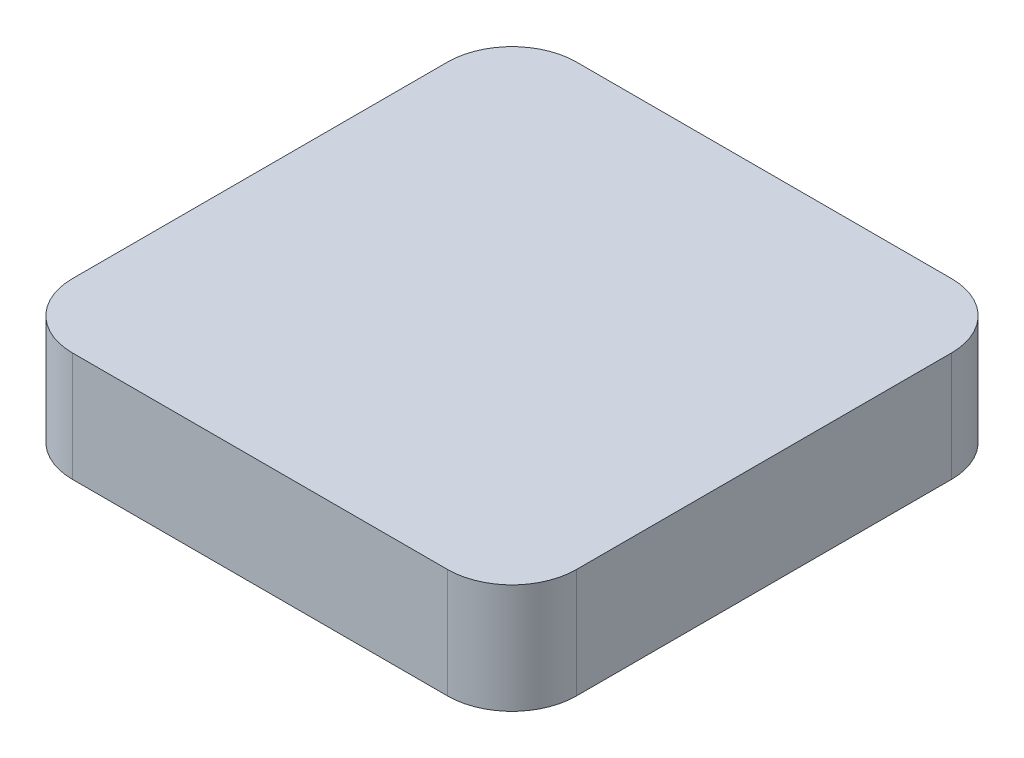
ISO-10303-21;
HEADER;
FILE_DESCRIPTION(('STEP AP214'),'2;1');
FILE_NAME('part.step','',(''),(''),'','','');
FILE_SCHEMA(('AUTOMOTIVE_DESIGN { 1 0 10303 214 1 1 1 1 }'));
ENDSEC;
DATA;
#1=APPLICATION_CONTEXT('core data for automotive mechanical design processes');
#2=APPLICATION_PROTOCOL_DEFINITION('international standard','automotive_design',2000,#1);
#3=PRODUCT_CONTEXT('',#1,'mechanical');
#4=PRODUCT('Part','Part','',(#3));
#5=PRODUCT_RELATED_PRODUCT_CATEGORY('part','',(#4));
#6=PRODUCT_DEFINITION_FORMATION('','',#4);
#7=PRODUCT_DEFINITION_CONTEXT('part definition',#1,'design');
#8=PRODUCT_DEFINITION('design','',#6,#7);
#9=PRODUCT_DEFINITION_SHAPE('','',#8);
#10=(LENGTH_UNIT() NAMED_UNIT(*) SI_UNIT(.MILLI.,.METRE.));
#11=(NAMED_UNIT(*) PLANE_ANGLE_UNIT() SI_UNIT($,.RADIAN.));
#12=(NAMED_UNIT(*) SI_UNIT($,.STERADIAN.) SOLID_ANGLE_UNIT());
#13=UNCERTAINTY_MEASURE_WITH_UNIT(LENGTH_MEASURE(1.E-05),#10,'distance_accuracy_value','');
#14=(GEOMETRIC_REPRESENTATION_CONTEXT(3) GLOBAL_UNCERTAINTY_ASSIGNED_CONTEXT((#13)) GLOBAL_UNIT_ASSIGNED_CONTEXT((#10,
#11,#12)) REPRESENTATION_CONTEXT('',''));
#15=CARTESIAN_POINT('',(0.,0.,0.));
#16=DIRECTION('',(0.,0.,1.));
#17=DIRECTION('',(1.,0.,0.));
#18=AXIS2_PLACEMENT_3D('',#15,#16,#17);
#19=CARTESIAN_POINT('',(10.1927350427351,8.5,-18.1297008547008));
#20=DIRECTION('',(-1.,0.,0.));
#21=DIRECTION('',(0.,0.,1.));
#22=AXIS2_PLACEMENT_3D('',#19,#20,#21);
#23=PLANE('',#22);
#24=DIRECTION('',(0.,0.,-1.));
#25=VECTOR('',#24,1.);
#26=CARTESIAN_POINT('',(10.1927350427351,0.,-18.1297008547008));
#27=LINE('',#26,#25);
#28=CARTESIAN_POINT('',(10.1927350427351,0.,15.9702991452992));
#29=VERTEX_POINT('',#28);
#30=CARTESIAN_POINT('',(10.1927350427351,0.,-13.1297008547008));
#31=VERTEX_POINT('',#30);
#32=EDGE_CURVE('E128',#29,#31,#27,.T.);
#33=ORIENTED_EDGE('',*,*,#32,.T.);
#34=DIRECTION('',(0.,-1.,0.));
#35=VECTOR('',#34,1.);
#36=CARTESIAN_POINT('',(10.1927350427351,8.5,-13.1297008547008));
#37=LINE('',#36,#35);
#38=CARTESIAN_POINT('',(10.1927350427351,8.5,-13.1297008547008));
#39=VERTEX_POINT('',#38);
#40=EDGE_CURVE('E106',#31,#39,#37,.F.);
#41=ORIENTED_EDGE('',*,*,#40,.T.);
#42=DIRECTION('',(0.,0.,-1.));
#43=VECTOR('',#42,1.);
#44=CARTESIAN_POINT('',(10.1927350427351,8.5,-18.1297008547008));
#45=LINE('',#44,#43);
#46=CARTESIAN_POINT('',(10.1927350427351,8.5,15.9702991452992));
#47=VERTEX_POINT('',#46);
#48=EDGE_CURVE('E137',#47,#39,#45,.T.);
#49=ORIENTED_EDGE('',*,*,#48,.F.);
#50=DIRECTION('',(0.,-1.,0.));
#51=VECTOR('',#50,1.);
#52=CARTESIAN_POINT('',(10.1927350427351,8.5,15.9702991452992));
#53=LINE('',#52,#51);
#54=EDGE_CURVE('E111',#47,#29,#53,.T.);
#55=ORIENTED_EDGE('',*,*,#54,.T.);
#56=EDGE_LOOP('',(#33,#41,#49,#55));
#57=FACE_BOUND('',#56,.T.);
#58=ADVANCED_FACE('F35',(#57),#23,.F.);
#59=CARTESIAN_POINT('',(-28.907264957265,8.5,-18.1297008547008));
#60=DIRECTION('',(0.,0.,1.));
#61=DIRECTION('',(1.,0.,0.));
#62=AXIS2_PLACEMENT_3D('',#59,#60,#61);
#63=PLANE('',#62);
#64=DIRECTION('',(-1.,0.,0.));
#65=VECTOR('',#64,1.);
#66=CARTESIAN_POINT('',(-28.907264957265,8.5,-18.1297008547008));
#67=LINE('',#66,#65);
#68=CARTESIAN_POINT('',(5.19273504273505,8.5,-18.1297008547008));
#69=VERTEX_POINT('',#68);
#70=CARTESIAN_POINT('',(-23.907264957265,8.5,-18.1297008547008));
#71=VERTEX_POINT('',#70);
#72=EDGE_CURVE('E121',#69,#71,#67,.T.);
#73=ORIENTED_EDGE('',*,*,#72,.F.);
#74=DIRECTION('',(0.,-1.,0.));
#75=VECTOR('',#74,1.);
#76=CARTESIAN_POINT('',(5.19273504273505,8.5,-18.1297008547008));
#77=LINE('',#76,#75);
#78=CARTESIAN_POINT('',(5.19273504273505,0.,-18.1297008547008));
#79=VERTEX_POINT('',#78);
#80=EDGE_CURVE('E105',#69,#79,#77,.T.);
#81=ORIENTED_EDGE('',*,*,#80,.T.);
#82=DIRECTION('',(-1.,0.,0.));
#83=VECTOR('',#82,1.);
#84=CARTESIAN_POINT('',(-28.907264957265,0.,-18.1297008547008));
#85=LINE('',#84,#83);
#86=CARTESIAN_POINT('',(-23.907264957265,0.,-18.1297008547008));
#87=VERTEX_POINT('',#86);
#88=EDGE_CURVE('E118',#79,#87,#85,.T.);
#89=ORIENTED_EDGE('',*,*,#88,.T.);
#90=DIRECTION('',(0.,-1.,0.));
#91=VECTOR('',#90,1.);
#92=CARTESIAN_POINT('',(-23.907264957265,8.5,-18.1297008547008));
#93=LINE('',#92,#91);
#94=EDGE_CURVE('E123',#87,#71,#93,.F.);
#95=ORIENTED_EDGE('',*,*,#94,.T.);
#96=EDGE_LOOP('',(#73,#81,#89,#95));
#97=FACE_BOUND('',#96,.T.);
#98=ADVANCED_FACE('F117',(#97),#63,.F.);
#99=CARTESIAN_POINT('',(-28.907264957265,8.5,-18.1297008547008));
#100=DIRECTION('',(1.,0.,0.));
#101=DIRECTION('',(0.,0.,-1.));
#102=AXIS2_PLACEMENT_3D('',#99,#100,#101);
#103=PLANE('',#102);
#104=DIRECTION('',(0.,0.,1.));
#105=VECTOR('',#104,1.);
#106=CARTESIAN_POINT('',(-28.907264957265,0.,-18.1297008547008));
#107=LINE('',#106,#105);
#108=CARTESIAN_POINT('',(-28.907264957265,0.,-13.1297008547008));
#109=VERTEX_POINT('',#108);
#110=CARTESIAN_POINT('',(-28.907264957265,0.,15.9702991452992));
#111=VERTEX_POINT('',#110);
#112=EDGE_CURVE('E127',#109,#111,#107,.T.);
#113=ORIENTED_EDGE('',*,*,#112,.T.);
#114=DIRECTION('',(0.,-1.,0.));
#115=VECTOR('',#114,1.);
#116=CARTESIAN_POINT('',(-28.907264957265,8.5,15.9702991452992));
#117=LINE('',#116,#115);
#118=CARTESIAN_POINT('',(-28.907264957265,8.5,15.9702991452992));
#119=VERTEX_POINT('',#118);
#120=EDGE_CURVE('E11',#111,#119,#117,.F.);
#121=ORIENTED_EDGE('',*,*,#120,.T.);
#122=DIRECTION('',(0.,0.,1.));
#123=VECTOR('',#122,1.);
#124=CARTESIAN_POINT('',(-28.907264957265,8.5,-18.1297008547008));
#125=LINE('',#124,#123);
#126=CARTESIAN_POINT('',(-28.907264957265,8.5,-13.1297008547008));
#127=VERTEX_POINT('',#126);
#128=EDGE_CURVE('E163',#127,#119,#125,.T.);
#129=ORIENTED_EDGE('',*,*,#128,.F.);
#130=DIRECTION('',(0.,-1.,0.));
#131=VECTOR('',#130,1.);
#132=CARTESIAN_POINT('',(-28.907264957265,8.5,-13.1297008547008));
#133=LINE('',#132,#131);
#134=EDGE_CURVE('E43',#127,#109,#133,.T.);
#135=ORIENTED_EDGE('',*,*,#134,.T.);
#136=EDGE_LOOP('',(#113,#121,#129,#135));
#137=FACE_BOUND('',#136,.T.);
#138=ADVANCED_FACE('F161',(#137),#103,.F.);
#139=CARTESIAN_POINT('',(-28.907264957265,8.5,20.9702991452992));
#140=DIRECTION('',(0.,0.,-1.));
#141=DIRECTION('',(-1.,0.,0.));
#142=AXIS2_PLACEMENT_3D('',#139,#140,#141);
#143=PLANE('',#142);
#144=DIRECTION('',(1.,0.,0.));
#145=VECTOR('',#144,1.);
#146=CARTESIAN_POINT('',(-28.907264957265,0.,20.9702991452992));
#147=LINE('',#146,#145);
#148=CARTESIAN_POINT('',(-23.907264957265,0.,20.9702991452992));
#149=VERTEX_POINT('',#148);
#150=CARTESIAN_POINT('',(5.19273504273505,0.,20.9702991452992));
#151=VERTEX_POINT('',#150);
#152=EDGE_CURVE('E131',#149,#151,#147,.T.);
#153=ORIENTED_EDGE('',*,*,#152,.T.);
#154=DIRECTION('',(0.,-1.,0.));
#155=VECTOR('',#154,1.);
#156=CARTESIAN_POINT('',(5.19273504273505,8.5,20.9702991452992));
#157=LINE('',#156,#155);
#158=CARTESIAN_POINT('',(5.19273504273505,8.5,20.9702991452992));
#159=VERTEX_POINT('',#158);
#160=EDGE_CURVE('E50',#151,#159,#157,.F.);
#161=ORIENTED_EDGE('',*,*,#160,.T.);
#162=DIRECTION('',(1.,0.,0.));
#163=VECTOR('',#162,1.);
#164=CARTESIAN_POINT('',(-28.907264957265,8.5,20.9702991452992));
#165=LINE('',#164,#163);
#166=CARTESIAN_POINT('',(-23.907264957265,8.5,20.9702991452992));
#167=VERTEX_POINT('',#166);
#168=EDGE_CURVE('E138',#167,#159,#165,.T.);
#169=ORIENTED_EDGE('',*,*,#168,.F.);
#170=DIRECTION('',(0.,-1.,0.));
#171=VECTOR('',#170,1.);
#172=CARTESIAN_POINT('',(-23.907264957265,8.5,20.9702991452992));
#173=LINE('',#172,#171);
#174=EDGE_CURVE('E154',#167,#149,#173,.T.);
#175=ORIENTED_EDGE('',*,*,#174,.T.);
#176=EDGE_LOOP('',(#153,#161,#169,#175));
#177=FACE_BOUND('',#176,.T.);
#178=ADVANCED_FACE('F170',(#177),#143,.F.);
#179=CARTESIAN_POINT('',(0.,8.5,0.));
#180=DIRECTION('',(0.,1.,0.));
#181=DIRECTION('',(0.,0.,1.));
#182=AXIS2_PLACEMENT_3D('',#179,#180,#181);
#183=PLANE('',#182);
#184=ORIENTED_EDGE('',*,*,#48,.T.);
#185=CARTESIAN_POINT('',(5.19273504273505,8.5,-13.1297008547008));
#186=DIRECTION('',(0.,1.,0.));
#187=DIRECTION('',(0.,0.,1.));
#188=AXIS2_PLACEMENT_3D('',#185,#186,#187);
#189=CIRCLE('',#188,5.);
#190=EDGE_CURVE('E152',#39,#69,#189,.T.);
#191=ORIENTED_EDGE('',*,*,#190,.T.);
#192=ORIENTED_EDGE('',*,*,#72,.T.);
#193=CARTESIAN_POINT('',(-23.907264957265,8.5,-13.1297008547008));
#194=DIRECTION('',(0.,1.,0.));
#195=DIRECTION('',(0.,0.,1.));
#196=AXIS2_PLACEMENT_3D('',#193,#194,#195);
#197=CIRCLE('',#196,5.);
#198=EDGE_CURVE('E147',#71,#127,#197,.T.);
#199=ORIENTED_EDGE('',*,*,#198,.T.);
#200=ORIENTED_EDGE('',*,*,#128,.T.);
#201=CARTESIAN_POINT('',(-23.907264957265,8.5,15.9702991452992));
#202=DIRECTION('',(0.,1.,0.));
#203=DIRECTION('',(0.,0.,1.));
#204=AXIS2_PLACEMENT_3D('',#201,#202,#203);
#205=CIRCLE('',#204,5.);
#206=EDGE_CURVE('E57',#119,#167,#205,.T.);
#207=ORIENTED_EDGE('',*,*,#206,.T.);
#208=ORIENTED_EDGE('',*,*,#168,.T.);
#209=CARTESIAN_POINT('',(5.19273504273505,8.5,15.9702991452992));
#210=DIRECTION('',(0.,1.,0.));
#211=DIRECTION('',(0.,0.,1.));
#212=AXIS2_PLACEMENT_3D('',#209,#210,#211);
#213=CIRCLE('',#212,5.);
#214=EDGE_CURVE('E150',#159,#47,#213,.T.);
#215=ORIENTED_EDGE('',*,*,#214,.T.);
#216=EDGE_LOOP('',(#184,#191,#192,#199,#200,#207,#208,#215));
#217=FACE_BOUND('',#216,.T.);
#218=ADVANCED_FACE('F177',(#217),#183,.T.);
#219=CARTESIAN_POINT('',(0.,0.,0.));
#220=DIRECTION('',(0.,1.,0.));
#221=DIRECTION('',(0.,0.,1.));
#222=AXIS2_PLACEMENT_3D('',#219,#220,#221);
#223=PLANE('',#222);
#224=ORIENTED_EDGE('',*,*,#88,.F.);
#225=CARTESIAN_POINT('',(5.19273504273505,0.,-13.1297008547008));
#226=DIRECTION('',(0.,1.,0.));
#227=DIRECTION('',(0.,0.,1.));
#228=AXIS2_PLACEMENT_3D('',#225,#226,#227);
#229=CIRCLE('',#228,5.);
#230=EDGE_CURVE('E101',#79,#31,#229,.F.);
#231=ORIENTED_EDGE('',*,*,#230,.T.);
#232=ORIENTED_EDGE('',*,*,#32,.F.);
#233=CARTESIAN_POINT('',(5.19273504273505,0.,15.9702991452992));
#234=DIRECTION('',(0.,1.,0.));
#235=DIRECTION('',(0.,0.,1.));
#236=AXIS2_PLACEMENT_3D('',#233,#234,#235);
#237=CIRCLE('',#236,5.);
#238=EDGE_CURVE('E112',#29,#151,#237,.F.);
#239=ORIENTED_EDGE('',*,*,#238,.T.);
#240=ORIENTED_EDGE('',*,*,#152,.F.);
#241=CARTESIAN_POINT('',(-23.907264957265,0.,15.9702991452992));
#242=DIRECTION('',(0.,1.,0.));
#243=DIRECTION('',(0.,0.,1.));
#244=AXIS2_PLACEMENT_3D('',#241,#242,#243);
#245=CIRCLE('',#244,5.);
#246=EDGE_CURVE('E141',#149,#111,#245,.F.);
#247=ORIENTED_EDGE('',*,*,#246,.T.);
#248=ORIENTED_EDGE('',*,*,#112,.F.);
#249=CARTESIAN_POINT('',(-23.907264957265,0.,-13.1297008547008));
#250=DIRECTION('',(0.,1.,0.));
#251=DIRECTION('',(0.,0.,1.));
#252=AXIS2_PLACEMENT_3D('',#249,#250,#251);
#253=CIRCLE('',#252,5.);
#254=EDGE_CURVE('E122',#109,#87,#253,.F.);
#255=ORIENTED_EDGE('',*,*,#254,.T.);
#256=EDGE_LOOP('',(#224,#231,#232,#239,#240,#247,#248,#255));
#257=FACE_BOUND('',#256,.T.);
#258=ADVANCED_FACE('F125',(#257),#223,.F.);
#259=CARTESIAN_POINT('',(5.19273504273505,8.5,-13.1297008547008));
#260=DIRECTION('',(0.,-1.,0.));
#261=DIRECTION('',(0.,0.,-1.));
#262=AXIS2_PLACEMENT_3D('',#259,#260,#261);
#263=CYLINDRICAL_SURFACE('',#262,5.);
#264=ORIENTED_EDGE('',*,*,#190,.F.);
#265=ORIENTED_EDGE('',*,*,#40,.F.);
#266=ORIENTED_EDGE('',*,*,#230,.F.);
#267=ORIENTED_EDGE('',*,*,#80,.F.);
#268=EDGE_LOOP('',(#264,#265,#266,#267));
#269=FACE_BOUND('',#268,.T.);
#270=ADVANCED_FACE('F104',(#269),#263,.T.);
#271=CARTESIAN_POINT('',(5.19273504273505,8.5,15.9702991452992));
#272=DIRECTION('',(0.,-1.,0.));
#273=DIRECTION('',(0.,0.,-1.));
#274=AXIS2_PLACEMENT_3D('',#271,#272,#273);
#275=CYLINDRICAL_SURFACE('',#274,5.);
#276=ORIENTED_EDGE('',*,*,#214,.F.);
#277=ORIENTED_EDGE('',*,*,#160,.F.);
#278=ORIENTED_EDGE('',*,*,#238,.F.);
#279=ORIENTED_EDGE('',*,*,#54,.F.);
#280=EDGE_LOOP('',(#276,#277,#278,#279));
#281=FACE_BOUND('',#280,.T.);
#282=ADVANCED_FACE('F181',(#281),#275,.T.);
#283=CARTESIAN_POINT('',(-23.907264957265,8.5,15.9702991452992));
#284=DIRECTION('',(0.,-1.,0.));
#285=DIRECTION('',(0.,0.,-1.));
#286=AXIS2_PLACEMENT_3D('',#283,#284,#285);
#287=CYLINDRICAL_SURFACE('',#286,5.);
#288=ORIENTED_EDGE('',*,*,#206,.F.);
#289=ORIENTED_EDGE('',*,*,#120,.F.);
#290=ORIENTED_EDGE('',*,*,#246,.F.);
#291=ORIENTED_EDGE('',*,*,#174,.F.);
#292=EDGE_LOOP('',(#288,#289,#290,#291));
#293=FACE_BOUND('',#292,.T.);
#294=ADVANCED_FACE('F169',(#293),#287,.T.);
#295=CARTESIAN_POINT('',(-23.907264957265,8.5,-13.1297008547008));
#296=DIRECTION('',(0.,-1.,0.));
#297=DIRECTION('',(0.,0.,-1.));
#298=AXIS2_PLACEMENT_3D('',#295,#296,#297);
#299=CYLINDRICAL_SURFACE('',#298,5.);
#300=ORIENTED_EDGE('',*,*,#198,.F.);
#301=ORIENTED_EDGE('',*,*,#94,.F.);
#302=ORIENTED_EDGE('',*,*,#254,.F.);
#303=ORIENTED_EDGE('',*,*,#134,.F.);
#304=EDGE_LOOP('',(#300,#301,#302,#303));
#305=FACE_BOUND('',#304,.T.);
#306=ADVANCED_FACE('F37',(#305),#299,.T.);
#307=CLOSED_SHELL('',(#58,#98,#138,#178,#218,#258,#270,#282,#294,#306));
#308=MANIFOLD_SOLID_BREP('B2',#307);
#309=ADVANCED_BREP_SHAPE_REPRESENTATION('',(#18,#308),#14);
#310=SHAPE_DEFINITION_REPRESENTATION(#9,#309);
ENDSEC;
END-ISO-10303-21;
